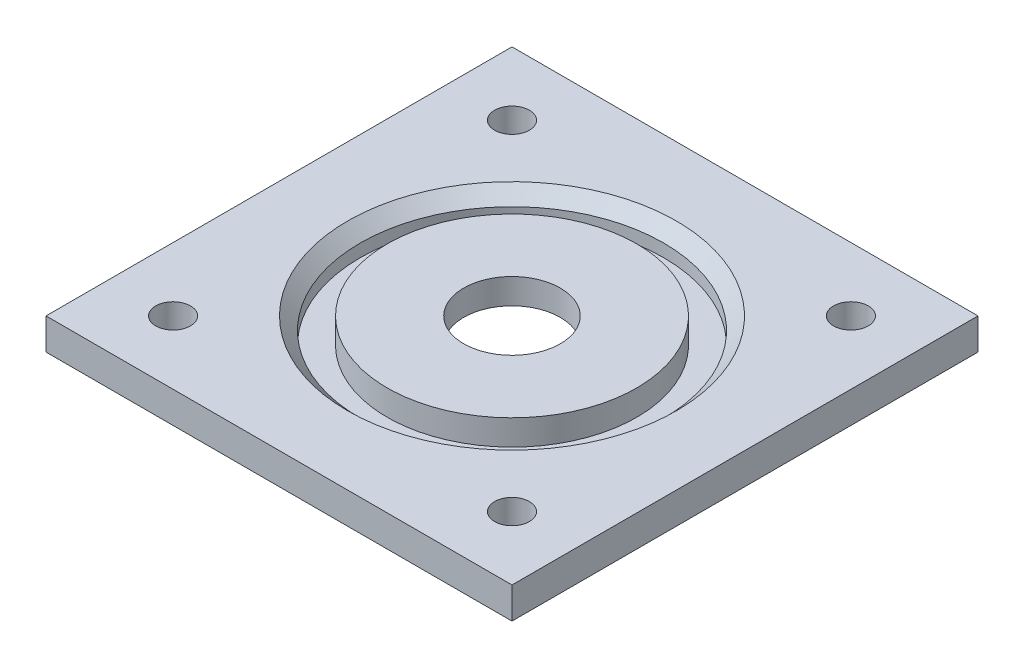
ISO-10303-21;
HEADER;
FILE_DESCRIPTION(('STEP AP214'),'2;1');
FILE_NAME('part.step','',(''),(''),'','','');
FILE_SCHEMA(('AUTOMOTIVE_DESIGN { 1 0 10303 214 1 1 1 1 }'));
ENDSEC;
DATA;
#1=APPLICATION_CONTEXT('core data for automotive mechanical design processes');
#2=APPLICATION_PROTOCOL_DEFINITION('international standard','automotive_design',2000,#1);
#3=PRODUCT_CONTEXT('',#1,'mechanical');
#4=PRODUCT('Part','Part','',(#3));
#5=PRODUCT_RELATED_PRODUCT_CATEGORY('part','',(#4));
#6=PRODUCT_DEFINITION_FORMATION('','',#4);
#7=PRODUCT_DEFINITION_CONTEXT('part definition',#1,'design');
#8=PRODUCT_DEFINITION('design','',#6,#7);
#9=PRODUCT_DEFINITION_SHAPE('','',#8);
#10=(LENGTH_UNIT() NAMED_UNIT(*) SI_UNIT(.MILLI.,.METRE.));
#11=(NAMED_UNIT(*) PLANE_ANGLE_UNIT() SI_UNIT($,.RADIAN.));
#12=(NAMED_UNIT(*) SI_UNIT($,.STERADIAN.) SOLID_ANGLE_UNIT());
#13=UNCERTAINTY_MEASURE_WITH_UNIT(LENGTH_MEASURE(1.E-05),#10,'distance_accuracy_value','');
#14=(GEOMETRIC_REPRESENTATION_CONTEXT(3) GLOBAL_UNCERTAINTY_ASSIGNED_CONTEXT((#13)) GLOBAL_UNIT_ASSIGNED_CONTEXT((#10,
#11,#12)) REPRESENTATION_CONTEXT('',''));
#15=CARTESIAN_POINT('',(0.,0.,0.));
#16=DIRECTION('',(0.,0.,1.));
#17=DIRECTION('',(1.,0.,0.));
#18=AXIS2_PLACEMENT_3D('',#15,#16,#17);
#19=CARTESIAN_POINT('',(19.7672047434114,0.,0.));
#20=DIRECTION('',(0.,1.,0.));
#21=DIRECTION('',(0.,0.,1.));
#22=AXIS2_PLACEMENT_3D('',#19,#20,#21);
#23=PLANE('',#22);
#24=CARTESIAN_POINT('',(-5.7,0.,0.));
#25=DIRECTION('',(0.,-1.,0.));
#26=DIRECTION('',(0.,0.,-1.));
#27=AXIS2_PLACEMENT_3D('',#24,#25,#26);
#28=CIRCLE('',#27,14.73);
#29=CARTESIAN_POINT('',(-5.7,0.,-14.73));
#30=VERTEX_POINT('',#29);
#31=EDGE_CURVE('E132',#30,#30,#28,.T.);
#32=ORIENTED_EDGE('',*,*,#31,.T.);
#33=EDGE_LOOP('',(#32));
#34=FACE_BOUND('',#33,.T.);
#35=CARTESIAN_POINT('',(-5.7,0.,0.));
#36=DIRECTION('',(0.,1.,0.));
#37=DIRECTION('',(0.,0.,1.));
#38=AXIS2_PLACEMENT_3D('',#35,#36,#37);
#39=CIRCLE('',#38,17.905);
#40=CARTESIAN_POINT('',(-5.7,0.,17.905));
#41=VERTEX_POINT('',#40);
#42=EDGE_CURVE('E144',#41,#41,#39,.F.);
#43=ORIENTED_EDGE('',*,*,#42,.F.);
#44=EDGE_LOOP('',(#43));
#45=FACE_BOUND('',#44,.T.);
#46=ADVANCED_FACE('F41',(#34,#45),#23,.T.);
#47=CARTESIAN_POINT('',(-5.7,-3.54929577464788,0.));
#48=DIRECTION('',(0.,-1.,0.));
#49=DIRECTION('',(0.,0.,-1.));
#50=AXIS2_PLACEMENT_3D('',#47,#48,#49);
#51=CYLINDRICAL_SURFACE('',#50,5.7);
#52=CARTESIAN_POINT('',(-5.7,0.,0.));
#53=DIRECTION('',(0.,-1.,0.));
#54=DIRECTION('',(0.,0.,-1.));
#55=AXIS2_PLACEMENT_3D('',#52,#53,#54);
#56=CIRCLE('',#55,5.7);
#57=CARTESIAN_POINT('',(-5.7,0.,-5.7));
#58=VERTEX_POINT('',#57);
#59=EDGE_CURVE('E141',#58,#58,#56,.T.);
#60=ORIENTED_EDGE('',*,*,#59,.T.);
#61=EDGE_LOOP('',(#60));
#62=FACE_BOUND('',#61,.T.);
#63=CARTESIAN_POINT('',(-5.7,3.,0.));
#64=DIRECTION('',(0.,-1.,0.));
#65=DIRECTION('',(0.,0.,-1.));
#66=AXIS2_PLACEMENT_3D('',#63,#64,#65);
#67=CIRCLE('',#66,5.7);
#68=CARTESIAN_POINT('',(-5.7,3.,-5.7));
#69=VERTEX_POINT('',#68);
#70=EDGE_CURVE('E125',#69,#69,#67,.T.);
#71=ORIENTED_EDGE('',*,*,#70,.F.);
#72=EDGE_LOOP('',(#71));
#73=FACE_BOUND('',#72,.T.);
#74=ADVANCED_FACE('F164',(#62,#73),#51,.F.);
#75=CARTESIAN_POINT('',(0.,0.,0.));
#76=DIRECTION('',(0.,-1.,0.));
#77=DIRECTION('',(0.,0.,-1.));
#78=AXIS2_PLACEMENT_3D('',#75,#76,#77);
#79=PLANE('',#78);
#80=CARTESIAN_POINT('',(-5.7,0.,0.));
#81=DIRECTION('',(0.,-1.,0.));
#82=DIRECTION('',(0.,0.,-1.));
#83=AXIS2_PLACEMENT_3D('',#80,#81,#82);
#84=CIRCLE('',#83,11.5);
#85=CARTESIAN_POINT('',(-5.7,0.,-11.5));
#86=VERTEX_POINT('',#85);
#87=EDGE_CURVE('E138',#86,#86,#84,.T.);
#88=ORIENTED_EDGE('',*,*,#87,.T.);
#89=EDGE_LOOP('',(#88));
#90=FACE_BOUND('',#89,.T.);
#91=ORIENTED_EDGE('',*,*,#59,.F.);
#92=EDGE_LOOP('',(#91));
#93=FACE_BOUND('',#92,.T.);
#94=ADVANCED_FACE('F172',(#90,#93),#79,.T.);
#95=CARTESIAN_POINT('',(-5.7,-3.54929577464788,0.));
#96=DIRECTION('',(0.,-1.,0.));
#97=DIRECTION('',(0.,0.,-1.));
#98=AXIS2_PLACEMENT_3D('',#95,#96,#97);
#99=CYLINDRICAL_SURFACE('',#98,11.5);
#100=CARTESIAN_POINT('',(-5.7,-0.7,0.));
#101=DIRECTION('',(0.,-1.,0.));
#102=DIRECTION('',(0.,0.,-1.));
#103=AXIS2_PLACEMENT_3D('',#100,#101,#102);
#104=CIRCLE('',#103,11.5);
#105=CARTESIAN_POINT('',(-5.7,-0.7,-11.5));
#106=VERTEX_POINT('',#105);
#107=EDGE_CURVE('E135',#106,#106,#104,.T.);
#108=ORIENTED_EDGE('',*,*,#107,.T.);
#109=EDGE_LOOP('',(#108));
#110=FACE_BOUND('',#109,.T.);
#111=ORIENTED_EDGE('',*,*,#87,.F.);
#112=EDGE_LOOP('',(#111));
#113=FACE_BOUND('',#112,.T.);
#114=ADVANCED_FACE('F182',(#110,#113),#99,.F.);
#115=CARTESIAN_POINT('',(5.8,-0.7,0.));
#116=DIRECTION('',(0.,-1.,0.));
#117=DIRECTION('',(0.,0.,-1.));
#118=AXIS2_PLACEMENT_3D('',#115,#116,#117);
#119=PLANE('',#118);
#120=CARTESIAN_POINT('',(14.3,-0.7,20.));
#121=DIRECTION('',(0.,-1.,0.));
#122=DIRECTION('',(0.,0.,-1.));
#123=AXIS2_PLACEMENT_3D('',#120,#121,#122);
#124=CIRCLE('',#123,2.05);
#125=CARTESIAN_POINT('',(14.3,-0.7,17.95));
#126=VERTEX_POINT('',#125);
#127=EDGE_CURVE('E109',#126,#126,#124,.T.);
#128=ORIENTED_EDGE('',*,*,#127,.F.);
#129=EDGE_LOOP('',(#128));
#130=FACE_BOUND('',#129,.T.);
#131=CARTESIAN_POINT('',(-25.7,-0.7,20.));
#132=DIRECTION('',(0.,-1.,0.));
#133=DIRECTION('',(0.,0.,-1.));
#134=AXIS2_PLACEMENT_3D('',#131,#132,#133);
#135=CIRCLE('',#134,2.05);
#136=CARTESIAN_POINT('',(-25.7,-0.7,17.95));
#137=VERTEX_POINT('',#136);
#138=EDGE_CURVE('E113',#137,#137,#135,.T.);
#139=ORIENTED_EDGE('',*,*,#138,.F.);
#140=EDGE_LOOP('',(#139));
#141=FACE_BOUND('',#140,.T.);
#142=CARTESIAN_POINT('',(-25.7,-0.7,-20.));
#143=DIRECTION('',(0.,-1.,0.));
#144=DIRECTION('',(0.,0.,-1.));
#145=AXIS2_PLACEMENT_3D('',#142,#143,#144);
#146=CIRCLE('',#145,2.05);
#147=CARTESIAN_POINT('',(-25.7,-0.7,-22.05));
#148=VERTEX_POINT('',#147);
#149=EDGE_CURVE('E350',#148,#148,#146,.T.);
#150=ORIENTED_EDGE('',*,*,#149,.F.);
#151=EDGE_LOOP('',(#150));
#152=FACE_BOUND('',#151,.T.);
#153=CARTESIAN_POINT('',(14.3,-0.7,-20.));
#154=DIRECTION('',(0.,-1.,0.));
#155=DIRECTION('',(0.,0.,-1.));
#156=AXIS2_PLACEMENT_3D('',#153,#154,#155);
#157=CIRCLE('',#156,2.05);
#158=CARTESIAN_POINT('',(14.3,-0.7,-22.05));
#159=VERTEX_POINT('',#158);
#160=EDGE_CURVE('E347',#159,#159,#157,.T.);
#161=ORIENTED_EDGE('',*,*,#160,.F.);
#162=EDGE_LOOP('',(#161));
#163=FACE_BOUND('',#162,.T.);
#164=DIRECTION('',(0.,0.,-1.));
#165=VECTOR('',#164,1.);
#166=CARTESIAN_POINT('',(21.8,-0.700000000000006,-27.5));
#167=LINE('',#166,#165);
#168=CARTESIAN_POINT('',(21.8,-0.700000000000006,27.5));
#169=VERTEX_POINT('',#168);
#170=CARTESIAN_POINT('',(21.8,-0.700000000000006,-27.5));
#171=VERTEX_POINT('',#170);
#172=EDGE_CURVE('E70',#169,#171,#167,.T.);
#173=ORIENTED_EDGE('',*,*,#172,.F.);
#174=DIRECTION('',(1.,0.,0.));
#175=VECTOR('',#174,1.);
#176=CARTESIAN_POINT('',(-33.2,-0.700000000000006,27.5));
#177=LINE('',#176,#175);
#178=CARTESIAN_POINT('',(-33.2,-0.700000000000006,27.5));
#179=VERTEX_POINT('',#178);
#180=EDGE_CURVE('E98',#179,#169,#177,.T.);
#181=ORIENTED_EDGE('',*,*,#180,.F.);
#182=DIRECTION('',(0.,0.,1.));
#183=VECTOR('',#182,1.);
#184=CARTESIAN_POINT('',(-33.2,-0.700000000000006,-27.5));
#185=LINE('',#184,#183);
#186=CARTESIAN_POINT('',(-33.2,-0.700000000000006,-27.5));
#187=VERTEX_POINT('',#186);
#188=EDGE_CURVE('E63',#187,#179,#185,.T.);
#189=ORIENTED_EDGE('',*,*,#188,.F.);
#190=DIRECTION('',(-1.,0.,0.));
#191=VECTOR('',#190,1.);
#192=CARTESIAN_POINT('',(-33.2,-0.700000000000006,-27.5));
#193=LINE('',#192,#191);
#194=EDGE_CURVE('E57',#171,#187,#193,.T.);
#195=ORIENTED_EDGE('',*,*,#194,.F.);
#196=EDGE_LOOP('',(#173,#181,#189,#195));
#197=FACE_BOUND('',#196,.T.);
#198=ORIENTED_EDGE('',*,*,#107,.F.);
#199=EDGE_LOOP('',(#198));
#200=FACE_BOUND('',#199,.T.);
#201=ADVANCED_FACE('F179',(#130,#141,#152,#163,#197,#200),#119,.T.);
#202=CARTESIAN_POINT('',(-5.7,-3.54929577464788,0.));
#203=DIRECTION('',(0.,-1.,0.));
#204=DIRECTION('',(0.,0.,-1.));
#205=AXIS2_PLACEMENT_3D('',#202,#203,#204);
#206=CYLINDRICAL_SURFACE('',#205,14.73);
#207=CARTESIAN_POINT('',(-5.7,3.,0.));
#208=DIRECTION('',(0.,-1.,0.));
#209=DIRECTION('',(0.,0.,-1.));
#210=AXIS2_PLACEMENT_3D('',#207,#208,#209);
#211=CIRCLE('',#210,14.73);
#212=CARTESIAN_POINT('',(-5.7,3.,-14.73));
#213=VERTEX_POINT('',#212);
#214=EDGE_CURVE('E129',#213,#213,#211,.T.);
#215=ORIENTED_EDGE('',*,*,#214,.T.);
#216=EDGE_LOOP('',(#215));
#217=FACE_BOUND('',#216,.T.);
#218=ORIENTED_EDGE('',*,*,#31,.F.);
#219=EDGE_LOOP('',(#218));
#220=FACE_BOUND('',#219,.T.);
#221=ADVANCED_FACE('F177',(#217,#220),#206,.T.);
#222=CARTESIAN_POINT('',(9.03,3.,0.));
#223=DIRECTION('',(0.,1.,0.));
#224=DIRECTION('',(0.,0.,1.));
#225=AXIS2_PLACEMENT_3D('',#222,#223,#224);
#226=PLANE('',#225);
#227=ORIENTED_EDGE('',*,*,#70,.T.);
#228=EDGE_LOOP('',(#227));
#229=FACE_BOUND('',#228,.T.);
#230=ORIENTED_EDGE('',*,*,#214,.F.);
#231=EDGE_LOOP('',(#230));
#232=FACE_BOUND('',#231,.T.);
#233=ADVANCED_FACE('F197',(#229,#232),#226,.T.);
#234=CARTESIAN_POINT('',(21.8,-78.4817459305202,-27.5));
#235=DIRECTION('',(1.,0.,0.));
#236=DIRECTION('',(0.,0.,-1.));
#237=AXIS2_PLACEMENT_3D('',#234,#235,#236);
#238=PLANE('',#237);
#239=DIRECTION('',(0.,1.,0.));
#240=VECTOR('',#239,1.);
#241=CARTESIAN_POINT('',(21.8,-78.4817459305202,27.5));
#242=LINE('',#241,#240);
#243=CARTESIAN_POINT('',(21.8,3.,27.5));
#244=VERTEX_POINT('',#243);
#245=EDGE_CURVE('E93',#169,#244,#242,.T.);
#246=ORIENTED_EDGE('',*,*,#245,.F.);
#247=ORIENTED_EDGE('',*,*,#172,.T.);
#248=DIRECTION('',(0.,1.,0.));
#249=VECTOR('',#248,1.);
#250=CARTESIAN_POINT('',(21.8,-78.4817459305202,-27.5));
#251=LINE('',#250,#249);
#252=CARTESIAN_POINT('',(21.8,3.,-27.5));
#253=VERTEX_POINT('',#252);
#254=EDGE_CURVE('E84',#171,#253,#251,.T.);
#255=ORIENTED_EDGE('',*,*,#254,.T.);
#256=DIRECTION('',(0.,0.,-1.));
#257=VECTOR('',#256,1.);
#258=CARTESIAN_POINT('',(21.8,3.,27.5));
#259=LINE('',#258,#257);
#260=EDGE_CURVE('E101',#244,#253,#259,.T.);
#261=ORIENTED_EDGE('',*,*,#260,.F.);
#262=EDGE_LOOP('',(#246,#247,#255,#261));
#263=FACE_BOUND('',#262,.T.);
#264=ADVANCED_FACE('F102',(#263),#238,.T.);
#265=CARTESIAN_POINT('',(-33.2,-78.4817459305202,27.5));
#266=DIRECTION('',(0.,0.,1.));
#267=DIRECTION('',(1.,0.,0.));
#268=AXIS2_PLACEMENT_3D('',#265,#266,#267);
#269=PLANE('',#268);
#270=DIRECTION('',(0.,1.,0.));
#271=VECTOR('',#270,1.);
#272=CARTESIAN_POINT('',(-33.2,-78.4817459305202,27.5));
#273=LINE('',#272,#271);
#274=CARTESIAN_POINT('',(-33.2,3.,27.5));
#275=VERTEX_POINT('',#274);
#276=EDGE_CURVE('E77',#179,#275,#273,.T.);
#277=ORIENTED_EDGE('',*,*,#276,.F.);
#278=ORIENTED_EDGE('',*,*,#180,.T.);
#279=ORIENTED_EDGE('',*,*,#245,.T.);
#280=DIRECTION('',(1.,0.,0.));
#281=VECTOR('',#280,1.);
#282=CARTESIAN_POINT('',(-33.2,3.,27.5));
#283=LINE('',#282,#281);
#284=EDGE_CURVE('E96',#275,#244,#283,.T.);
#285=ORIENTED_EDGE('',*,*,#284,.F.);
#286=EDGE_LOOP('',(#277,#278,#279,#285));
#287=FACE_BOUND('',#286,.T.);
#288=ADVANCED_FACE('F94',(#287),#269,.T.);
#289=CARTESIAN_POINT('',(-33.2,-78.4817459305202,-27.5));
#290=DIRECTION('',(-1.,0.,0.));
#291=DIRECTION('',(0.,0.,1.));
#292=AXIS2_PLACEMENT_3D('',#289,#290,#291);
#293=PLANE('',#292);
#294=DIRECTION('',(0.,1.,0.));
#295=VECTOR('',#294,1.);
#296=CARTESIAN_POINT('',(-33.2,-78.4817459305202,-27.5));
#297=LINE('',#296,#295);
#298=CARTESIAN_POINT('',(-33.2,3.,-27.5));
#299=VERTEX_POINT('',#298);
#300=EDGE_CURVE('E119',#187,#299,#297,.T.);
#301=ORIENTED_EDGE('',*,*,#300,.F.);
#302=ORIENTED_EDGE('',*,*,#188,.T.);
#303=ORIENTED_EDGE('',*,*,#276,.T.);
#304=DIRECTION('',(0.,0.,1.));
#305=VECTOR('',#304,1.);
#306=CARTESIAN_POINT('',(-33.2,3.,27.5));
#307=LINE('',#306,#305);
#308=EDGE_CURVE('E108',#299,#275,#307,.T.);
#309=ORIENTED_EDGE('',*,*,#308,.F.);
#310=EDGE_LOOP('',(#301,#302,#303,#309));
#311=FACE_BOUND('',#310,.T.);
#312=ADVANCED_FACE('F244',(#311),#293,.T.);
#313=CARTESIAN_POINT('',(-33.2,-78.4817459305202,-27.5));
#314=DIRECTION('',(0.,0.,-1.));
#315=DIRECTION('',(-1.,0.,0.));
#316=AXIS2_PLACEMENT_3D('',#313,#314,#315);
#317=PLANE('',#316);
#318=ORIENTED_EDGE('',*,*,#254,.F.);
#319=ORIENTED_EDGE('',*,*,#194,.T.);
#320=ORIENTED_EDGE('',*,*,#300,.T.);
#321=DIRECTION('',(-1.,0.,0.));
#322=VECTOR('',#321,1.);
#323=CARTESIAN_POINT('',(-33.2,3.,-27.5));
#324=LINE('',#323,#322);
#325=EDGE_CURVE('E105',#253,#299,#324,.T.);
#326=ORIENTED_EDGE('',*,*,#325,.F.);
#327=EDGE_LOOP('',(#318,#319,#320,#326));
#328=FACE_BOUND('',#327,.T.);
#329=ADVANCED_FACE('F255',(#328),#317,.T.);
#330=CARTESIAN_POINT('',(-5.7,80.7817459305202,0.));
#331=DIRECTION('',(0.,-1.,0.));
#332=DIRECTION('',(0.,0.,-1.));
#333=AXIS2_PLACEMENT_3D('',#330,#331,#332);
#334=CYLINDRICAL_SURFACE('',#333,17.905);
#335=CARTESIAN_POINT('',(-5.7,1.5,0.));
#336=DIRECTION('',(0.,1.,0.));
#337=DIRECTION('',(0.,0.,1.));
#338=AXIS2_PLACEMENT_3D('',#335,#336,#337);
#339=CIRCLE('',#338,17.905);
#340=CARTESIAN_POINT('',(-5.7,1.5,17.905));
#341=VERTEX_POINT('',#340);
#342=EDGE_CURVE('E50',#341,#341,#339,.T.);
#343=ORIENTED_EDGE('',*,*,#342,.T.);
#344=EDGE_LOOP('',(#343));
#345=FACE_BOUND('',#344,.T.);
#346=ORIENTED_EDGE('',*,*,#42,.T.);
#347=EDGE_LOOP('',(#346));
#348=FACE_BOUND('',#347,.T.);
#349=ADVANCED_FACE('F149',(#345,#348),#334,.F.);
#350=CARTESIAN_POINT('',(9.03,3.,0.));
#351=DIRECTION('',(0.,1.,0.));
#352=DIRECTION('',(0.,0.,1.));
#353=AXIS2_PLACEMENT_3D('',#350,#351,#352);
#354=PLANE('',#353);
#355=CARTESIAN_POINT('',(-5.7,3.,0.));
#356=DIRECTION('',(0.,1.,0.));
#357=DIRECTION('',(0.,0.,1.));
#358=AXIS2_PLACEMENT_3D('',#355,#356,#357);
#359=CIRCLE('',#358,19.405);
#360=CARTESIAN_POINT('',(-5.7,3.,19.405));
#361=VERTEX_POINT('',#360);
#362=EDGE_CURVE('E11',#361,#361,#359,.F.);
#363=ORIENTED_EDGE('',*,*,#362,.T.);
#364=EDGE_LOOP('',(#363));
#365=FACE_BOUND('',#364,.T.);
#366=CARTESIAN_POINT('',(14.3,3.,20.));
#367=DIRECTION('',(0.,1.,0.));
#368=DIRECTION('',(0.,0.,1.));
#369=AXIS2_PLACEMENT_3D('',#366,#367,#368);
#370=CIRCLE('',#369,2.05);
#371=CARTESIAN_POINT('',(14.3,3.,22.05));
#372=VERTEX_POINT('',#371);
#373=EDGE_CURVE('E337',#372,#372,#370,.T.);
#374=ORIENTED_EDGE('',*,*,#373,.F.);
#375=EDGE_LOOP('',(#374));
#376=FACE_BOUND('',#375,.T.);
#377=CARTESIAN_POINT('',(-25.7,3.,20.));
#378=DIRECTION('',(0.,1.,0.));
#379=DIRECTION('',(0.,0.,1.));
#380=AXIS2_PLACEMENT_3D('',#377,#378,#379);
#381=CIRCLE('',#380,2.05);
#382=CARTESIAN_POINT('',(-25.7,3.,22.05));
#383=VERTEX_POINT('',#382);
#384=EDGE_CURVE('E334',#383,#383,#381,.T.);
#385=ORIENTED_EDGE('',*,*,#384,.F.);
#386=EDGE_LOOP('',(#385));
#387=FACE_BOUND('',#386,.T.);
#388=CARTESIAN_POINT('',(-25.7,3.,-20.));
#389=DIRECTION('',(0.,1.,0.));
#390=DIRECTION('',(0.,0.,1.));
#391=AXIS2_PLACEMENT_3D('',#388,#389,#390);
#392=CIRCLE('',#391,2.05);
#393=CARTESIAN_POINT('',(-25.7,3.,-17.95));
#394=VERTEX_POINT('',#393);
#395=EDGE_CURVE('E336',#394,#394,#392,.T.);
#396=ORIENTED_EDGE('',*,*,#395,.F.);
#397=EDGE_LOOP('',(#396));
#398=FACE_BOUND('',#397,.T.);
#399=CARTESIAN_POINT('',(14.3,3.,-20.));
#400=DIRECTION('',(0.,1.,0.));
#401=DIRECTION('',(0.,0.,1.));
#402=AXIS2_PLACEMENT_3D('',#399,#400,#401);
#403=CIRCLE('',#402,2.05);
#404=CARTESIAN_POINT('',(14.3,3.,-17.95));
#405=VERTEX_POINT('',#404);
#406=EDGE_CURVE('E340',#405,#405,#403,.T.);
#407=ORIENTED_EDGE('',*,*,#406,.F.);
#408=EDGE_LOOP('',(#407));
#409=FACE_BOUND('',#408,.T.);
#410=ORIENTED_EDGE('',*,*,#284,.T.);
#411=ORIENTED_EDGE('',*,*,#260,.T.);
#412=ORIENTED_EDGE('',*,*,#325,.T.);
#413=ORIENTED_EDGE('',*,*,#308,.T.);
#414=EDGE_LOOP('',(#410,#411,#412,#413));
#415=FACE_BOUND('',#414,.T.);
#416=ADVANCED_FACE('F107',(#365,#376,#387,#398,#409,#415),#354,.T.);
#417=CARTESIAN_POINT('',(14.3,-7.,-20.));
#418=DIRECTION('',(0.,1.,0.));
#419=DIRECTION('',(0.,0.,1.));
#420=AXIS2_PLACEMENT_3D('',#417,#418,#419);
#421=CYLINDRICAL_SURFACE('',#420,2.05);
#422=ORIENTED_EDGE('',*,*,#160,.T.);
#423=EDGE_LOOP('',(#422));
#424=FACE_BOUND('',#423,.T.);
#425=ORIENTED_EDGE('',*,*,#406,.T.);
#426=EDGE_LOOP('',(#425));
#427=FACE_BOUND('',#426,.T.);
#428=ADVANCED_FACE('F286',(#424,#427),#421,.F.);
#429=CARTESIAN_POINT('',(-25.7,-7.,-20.));
#430=DIRECTION('',(0.,1.,0.));
#431=DIRECTION('',(0.,0.,1.));
#432=AXIS2_PLACEMENT_3D('',#429,#430,#431);
#433=CYLINDRICAL_SURFACE('',#432,2.05);
#434=ORIENTED_EDGE('',*,*,#149,.T.);
#435=EDGE_LOOP('',(#434));
#436=FACE_BOUND('',#435,.T.);
#437=ORIENTED_EDGE('',*,*,#395,.T.);
#438=EDGE_LOOP('',(#437));
#439=FACE_BOUND('',#438,.T.);
#440=ADVANCED_FACE('F294',(#436,#439),#433,.F.);
#441=CARTESIAN_POINT('',(-25.7,-7.,20.));
#442=DIRECTION('',(0.,1.,0.));
#443=DIRECTION('',(0.,0.,1.));
#444=AXIS2_PLACEMENT_3D('',#441,#442,#443);
#445=CYLINDRICAL_SURFACE('',#444,2.05);
#446=ORIENTED_EDGE('',*,*,#138,.T.);
#447=EDGE_LOOP('',(#446));
#448=FACE_BOUND('',#447,.T.);
#449=ORIENTED_EDGE('',*,*,#384,.T.);
#450=EDGE_LOOP('',(#449));
#451=FACE_BOUND('',#450,.T.);
#452=ADVANCED_FACE('F159',(#448,#451),#445,.F.);
#453=CARTESIAN_POINT('',(14.3,-7.,20.));
#454=DIRECTION('',(0.,1.,0.));
#455=DIRECTION('',(0.,0.,1.));
#456=AXIS2_PLACEMENT_3D('',#453,#454,#455);
#457=CYLINDRICAL_SURFACE('',#456,2.05);
#458=ORIENTED_EDGE('',*,*,#127,.T.);
#459=EDGE_LOOP('',(#458));
#460=FACE_BOUND('',#459,.T.);
#461=ORIENTED_EDGE('',*,*,#373,.T.);
#462=EDGE_LOOP('',(#461));
#463=FACE_BOUND('',#462,.T.);
#464=ADVANCED_FACE('F153',(#460,#463),#457,.F.);
#465=CARTESIAN_POINT('',(-5.7,1.5,0.));
#466=DIRECTION('',(0.,1.,0.));
#467=DIRECTION('',(0.,0.,1.));
#468=AXIS2_PLACEMENT_3D('',#465,#466,#467);
#469=CONICAL_SURFACE('',#468,17.905,0.785398163397445);
#470=ORIENTED_EDGE('',*,*,#362,.F.);
#471=EDGE_LOOP('',(#470));
#472=FACE_BOUND('',#471,.T.);
#473=ORIENTED_EDGE('',*,*,#342,.F.);
#474=EDGE_LOOP('',(#473));
#475=FACE_BOUND('',#474,.T.);
#476=ADVANCED_FACE('F44',(#472,#475),#469,.F.);
#477=CLOSED_SHELL('',(#46,#74,#94,#114,#201,#221,#233,#264,#288,#312,#329,#349,#416,#428,#440,
#452,#464,#476));
#478=MANIFOLD_SOLID_BREP('B2',#477);
#479=ADVANCED_BREP_SHAPE_REPRESENTATION('',(#18,#478),#14);
#480=SHAPE_DEFINITION_REPRESENTATION(#9,#479);
ENDSEC;
END-ISO-10303-21;
